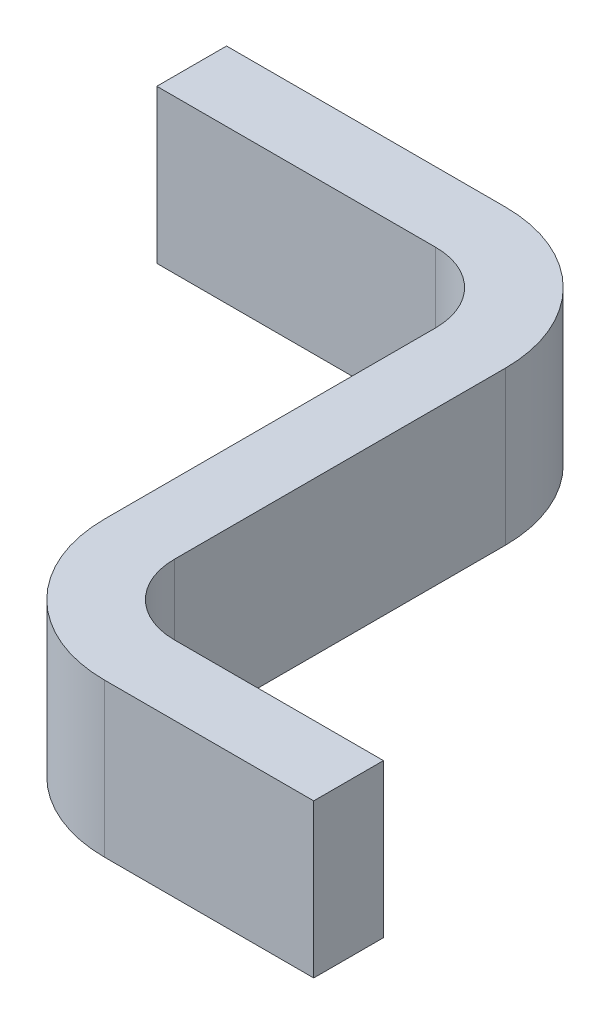
ISO-10303-21;
HEADER;
FILE_DESCRIPTION(('STEP AP214'),'2;1');
FILE_NAME('part.step','',(''),(''),'','','');
FILE_SCHEMA(('AUTOMOTIVE_DESIGN { 1 0 10303 214 1 1 1 1 }'));
ENDSEC;
DATA;
#1=APPLICATION_CONTEXT('core data for automotive mechanical design processes');
#2=APPLICATION_PROTOCOL_DEFINITION('international standard','automotive_design',2000,#1);
#3=PRODUCT_CONTEXT('',#1,'mechanical');
#4=PRODUCT('Part','Part','',(#3));
#5=PRODUCT_RELATED_PRODUCT_CATEGORY('part','',(#4));
#6=PRODUCT_DEFINITION_FORMATION('','',#4);
#7=PRODUCT_DEFINITION_CONTEXT('part definition',#1,'design');
#8=PRODUCT_DEFINITION('design','',#6,#7);
#9=PRODUCT_DEFINITION_SHAPE('','',#8);
#10=(LENGTH_UNIT() NAMED_UNIT(*) SI_UNIT(.MILLI.,.METRE.));
#11=(NAMED_UNIT(*) PLANE_ANGLE_UNIT() SI_UNIT($,.RADIAN.));
#12=(NAMED_UNIT(*) SI_UNIT($,.STERADIAN.) SOLID_ANGLE_UNIT());
#13=UNCERTAINTY_MEASURE_WITH_UNIT(LENGTH_MEASURE(1.E-05),#10,'distance_accuracy_value','');
#14=(GEOMETRIC_REPRESENTATION_CONTEXT(3) GLOBAL_UNCERTAINTY_ASSIGNED_CONTEXT((#13)) GLOBAL_UNIT_ASSIGNED_CONTEXT((#10,
#11,#12)) REPRESENTATION_CONTEXT('',''));
#15=CARTESIAN_POINT('',(0.,0.,0.));
#16=DIRECTION('',(0.,0.,1.));
#17=DIRECTION('',(1.,0.,0.));
#18=AXIS2_PLACEMENT_3D('',#15,#16,#17);
#19=CARTESIAN_POINT('',(-4.,0.86,0.675));
#20=DIRECTION('',(0.,-1.,0.));
#21=DIRECTION('',(1.,0.,0.));
#22=AXIS2_PLACEMENT_3D('',#19,#20,#21);
#23=PLANE('',#22);
#24=CARTESIAN_POINT('',(-3.8,0.860000000000001,0.675));
#25=DIRECTION('',(0.,1.,0.));
#26=DIRECTION('',(-1.,0.,0.));
#27=AXIS2_PLACEMENT_3D('',#24,#25,#26);
#28=CIRCLE('',#27,0.2);
#29=CARTESIAN_POINT('',(-3.8,0.860000000000001,0.875));
#30=VERTEX_POINT('',#29);
#31=CARTESIAN_POINT('',(-4.,0.86,0.675));
#32=VERTEX_POINT('',#31);
#33=EDGE_CURVE('E150',#30,#32,#28,.F.);
#34=ORIENTED_EDGE('',*,*,#33,.F.);
#35=DIRECTION('',(-1.,0.,0.));
#36=VECTOR('',#35,1.);
#37=CARTESIAN_POINT('',(-3.50000000000001,0.86,0.875));
#38=LINE('',#37,#36);
#39=CARTESIAN_POINT('',(-3.50000000000001,0.86,0.875));
#40=VERTEX_POINT('',#39);
#41=EDGE_CURVE('E147',#30,#40,#38,.F.);
#42=ORIENTED_EDGE('',*,*,#41,.T.);
#43=DIRECTION('',(0.,0.,1.));
#44=VECTOR('',#43,1.);
#45=CARTESIAN_POINT('',(-3.50000000000001,0.86,0.775));
#46=LINE('',#45,#44);
#47=CARTESIAN_POINT('',(-3.50000000000001,0.86,0.775));
#48=VERTEX_POINT('',#47);
#49=EDGE_CURVE('E141',#48,#40,#46,.T.);
#50=ORIENTED_EDGE('',*,*,#49,.F.);
#51=DIRECTION('',(1.,0.,0.));
#52=VECTOR('',#51,1.);
#53=CARTESIAN_POINT('',(-3.50000000000001,0.86,0.775));
#54=LINE('',#53,#52);
#55=CARTESIAN_POINT('',(-3.8,0.860000000000001,0.775));
#56=VERTEX_POINT('',#55);
#57=EDGE_CURVE('E115',#48,#56,#54,.F.);
#58=ORIENTED_EDGE('',*,*,#57,.T.);
#59=CARTESIAN_POINT('',(-3.8,0.860000000000001,0.675));
#60=DIRECTION('',(0.,1.,0.));
#61=DIRECTION('',(-1.,0.,0.));
#62=AXIS2_PLACEMENT_3D('',#59,#60,#61);
#63=CIRCLE('',#62,0.1);
#64=CARTESIAN_POINT('',(-3.90000000000001,0.860000000000001,0.675));
#65=VERTEX_POINT('',#64);
#66=EDGE_CURVE('E215',#56,#65,#63,.F.);
#67=ORIENTED_EDGE('',*,*,#66,.T.);
#68=DIRECTION('',(0.,0.,1.));
#69=VECTOR('',#68,1.);
#70=CARTESIAN_POINT('',(-3.90000000000001,0.860000000000001,0.675));
#71=LINE('',#70,#69);
#72=CARTESIAN_POINT('',(-3.90000000000001,0.860000000000001,0.2));
#73=VERTEX_POINT('',#72);
#74=EDGE_CURVE('E181',#65,#73,#71,.F.);
#75=ORIENTED_EDGE('',*,*,#74,.T.);
#76=CARTESIAN_POINT('',(-4.1,0.86,0.2));
#77=DIRECTION('',(0.,-1.,0.));
#78=DIRECTION('',(1.,0.,0.));
#79=AXIS2_PLACEMENT_3D('',#76,#77,#78);
#80=CIRCLE('',#79,0.2);
#81=CARTESIAN_POINT('',(-4.1,0.86,0.));
#82=VERTEX_POINT('',#81);
#83=EDGE_CURVE('E20',#82,#73,#80,.T.);
#84=ORIENTED_EDGE('',*,*,#83,.F.);
#85=DIRECTION('',(1.,0.,0.));
#86=VECTOR('',#85,1.);
#87=CARTESIAN_POINT('',(-4.1,0.86,0.));
#88=LINE('',#87,#86);
#89=CARTESIAN_POINT('',(-4.5,0.86,0.));
#90=VERTEX_POINT('',#89);
#91=EDGE_CURVE('E91',#82,#90,#88,.F.);
#92=ORIENTED_EDGE('',*,*,#91,.T.);
#93=DIRECTION('',(0.,0.,1.));
#94=VECTOR('',#93,1.);
#95=CARTESIAN_POINT('',(-4.5,0.86,0.));
#96=LINE('',#95,#94);
#97=CARTESIAN_POINT('',(-4.5,0.86,0.1));
#98=VERTEX_POINT('',#97);
#99=EDGE_CURVE('E163',#90,#98,#96,.T.);
#100=ORIENTED_EDGE('',*,*,#99,.T.);
#101=DIRECTION('',(-1.,0.,0.));
#102=VECTOR('',#101,1.);
#103=CARTESIAN_POINT('',(-4.1,0.86,0.1));
#104=LINE('',#103,#102);
#105=CARTESIAN_POINT('',(-4.1,0.86,0.1));
#106=VERTEX_POINT('',#105);
#107=EDGE_CURVE('E159',#98,#106,#104,.F.);
#108=ORIENTED_EDGE('',*,*,#107,.T.);
#109=CARTESIAN_POINT('',(-4.1,0.86,0.2));
#110=DIRECTION('',(0.,-1.,0.));
#111=DIRECTION('',(1.,0.,0.));
#112=AXIS2_PLACEMENT_3D('',#109,#110,#111);
#113=CIRCLE('',#112,0.1);
#114=CARTESIAN_POINT('',(-4.,0.86,0.2));
#115=VERTEX_POINT('',#114);
#116=EDGE_CURVE('E155',#106,#115,#113,.T.);
#117=ORIENTED_EDGE('',*,*,#116,.T.);
#118=DIRECTION('',(0.,0.,1.));
#119=VECTOR('',#118,1.);
#120=CARTESIAN_POINT('',(-4.,0.86,0.675));
#121=LINE('',#120,#119);
#122=EDGE_CURVE('E154',#115,#32,#121,.T.);
#123=ORIENTED_EDGE('',*,*,#122,.T.);
#124=EDGE_LOOP('',(#34,#42,#50,#58,#67,#75,#84,#92,#100,#108,#117,#123));
#125=FACE_BOUND('',#124,.T.);
#126=ADVANCED_FACE('F17',(#125),#23,.F.);
#127=CARTESIAN_POINT('',(-4.1,0.86,0.2));
#128=DIRECTION('',(0.,-1.,0.));
#129=DIRECTION('',(1.,0.,0.));
#130=AXIS2_PLACEMENT_3D('',#127,#128,#129);
#131=CYLINDRICAL_SURFACE('',#130,0.2);
#132=CARTESIAN_POINT('',(-4.1,0.64,0.2));
#133=DIRECTION('',(0.,-1.,0.));
#134=DIRECTION('',(1.,0.,0.));
#135=AXIS2_PLACEMENT_3D('',#132,#133,#134);
#136=CIRCLE('',#135,0.2);
#137=CARTESIAN_POINT('',(-3.90000000000001,0.640000000000001,0.2));
#138=VERTEX_POINT('',#137);
#139=CARTESIAN_POINT('',(-4.1,0.64,0.));
#140=VERTEX_POINT('',#139);
#141=EDGE_CURVE('E183',#138,#140,#136,.F.);
#142=ORIENTED_EDGE('',*,*,#141,.T.);
#143=DIRECTION('',(0.,1.,0.));
#144=VECTOR('',#143,1.);
#145=CARTESIAN_POINT('',(-4.1,0.86,0.));
#146=LINE('',#145,#144);
#147=EDGE_CURVE('E178',#140,#82,#146,.T.);
#148=ORIENTED_EDGE('',*,*,#147,.T.);
#149=ORIENTED_EDGE('',*,*,#83,.T.);
#150=DIRECTION('',(0.,-1.,0.));
#151=VECTOR('',#150,1.);
#152=CARTESIAN_POINT('',(-3.90000000000001,0.860000000000001,0.2));
#153=LINE('',#152,#151);
#154=EDGE_CURVE('E217',#73,#138,#153,.T.);
#155=ORIENTED_EDGE('',*,*,#154,.T.);
#156=EDGE_LOOP('',(#142,#148,#149,#155));
#157=FACE_BOUND('',#156,.T.);
#158=ADVANCED_FACE('F254',(#157),#131,.T.);
#159=CARTESIAN_POINT('',(-4.1,0.86,0.));
#160=DIRECTION('',(0.,0.,1.));
#161=DIRECTION('',(1.,0.,0.));
#162=AXIS2_PLACEMENT_3D('',#159,#160,#161);
#163=PLANE('',#162);
#164=ORIENTED_EDGE('',*,*,#147,.F.);
#165=DIRECTION('',(-1.,0.,0.));
#166=VECTOR('',#165,1.);
#167=CARTESIAN_POINT('',(-3.90000000000001,0.640000000000001,0.));
#168=LINE('',#167,#166);
#169=CARTESIAN_POINT('',(-4.5,0.64,0.));
#170=VERTEX_POINT('',#169);
#171=EDGE_CURVE('E170',#140,#170,#168,.T.);
#172=ORIENTED_EDGE('',*,*,#171,.T.);
#173=DIRECTION('',(0.,1.,0.));
#174=VECTOR('',#173,1.);
#175=CARTESIAN_POINT('',(-4.5,0.86,0.));
#176=LINE('',#175,#174);
#177=EDGE_CURVE('E173',#170,#90,#176,.T.);
#178=ORIENTED_EDGE('',*,*,#177,.T.);
#179=ORIENTED_EDGE('',*,*,#91,.F.);
#180=EDGE_LOOP('',(#164,#172,#178,#179));
#181=FACE_BOUND('',#180,.T.);
#182=ADVANCED_FACE('F257',(#181),#163,.F.);
#183=CARTESIAN_POINT('',(-4.5,0.86,0.));
#184=DIRECTION('',(1.,0.,0.));
#185=DIRECTION('',(0.,1.,0.));
#186=AXIS2_PLACEMENT_3D('',#183,#184,#185);
#187=PLANE('',#186);
#188=DIRECTION('',(0.,1.,0.));
#189=VECTOR('',#188,1.);
#190=CARTESIAN_POINT('',(-4.5,0.64,0.1));
#191=LINE('',#190,#189);
#192=CARTESIAN_POINT('',(-4.5,0.64,0.1));
#193=VERTEX_POINT('',#192);
#194=EDGE_CURVE('E160',#193,#98,#191,.T.);
#195=ORIENTED_EDGE('',*,*,#194,.T.);
#196=ORIENTED_EDGE('',*,*,#99,.F.);
#197=ORIENTED_EDGE('',*,*,#177,.F.);
#198=DIRECTION('',(0.,0.,1.));
#199=VECTOR('',#198,1.);
#200=CARTESIAN_POINT('',(-4.5,0.64,0.675));
#201=LINE('',#200,#199);
#202=EDGE_CURVE('E166',#170,#193,#201,.T.);
#203=ORIENTED_EDGE('',*,*,#202,.T.);
#204=EDGE_LOOP('',(#195,#196,#197,#203));
#205=FACE_BOUND('',#204,.T.);
#206=ADVANCED_FACE('F259',(#205),#187,.F.);
#207=CARTESIAN_POINT('',(-4.1,0.64,0.1));
#208=DIRECTION('',(0.,0.,-1.));
#209=DIRECTION('',(-1.,0.,0.));
#210=AXIS2_PLACEMENT_3D('',#207,#208,#209);
#211=PLANE('',#210);
#212=DIRECTION('',(0.,-1.,0.));
#213=VECTOR('',#212,1.);
#214=CARTESIAN_POINT('',(-4.1,0.64,0.1));
#215=LINE('',#214,#213);
#216=CARTESIAN_POINT('',(-4.1,0.64,0.1));
#217=VERTEX_POINT('',#216);
#218=EDGE_CURVE('E156',#217,#106,#215,.F.);
#219=ORIENTED_EDGE('',*,*,#218,.T.);
#220=ORIENTED_EDGE('',*,*,#107,.F.);
#221=ORIENTED_EDGE('',*,*,#194,.F.);
#222=DIRECTION('',(-1.,0.,0.));
#223=VECTOR('',#222,1.);
#224=CARTESIAN_POINT('',(-3.90000000000001,0.640000000000001,0.1));
#225=LINE('',#224,#223);
#226=EDGE_CURVE('E169',#193,#217,#225,.F.);
#227=ORIENTED_EDGE('',*,*,#226,.T.);
#228=EDGE_LOOP('',(#219,#220,#221,#227));
#229=FACE_BOUND('',#228,.T.);
#230=ADVANCED_FACE('F234',(#229),#211,.F.);
#231=CARTESIAN_POINT('',(-4.1,0.64,0.2));
#232=DIRECTION('',(0.,-1.,0.));
#233=DIRECTION('',(1.,0.,0.));
#234=AXIS2_PLACEMENT_3D('',#231,#232,#233);
#235=CYLINDRICAL_SURFACE('',#234,0.1);
#236=DIRECTION('',(0.,1.,0.));
#237=VECTOR('',#236,1.);
#238=CARTESIAN_POINT('',(-4.,0.64,0.2));
#239=LINE('',#238,#237);
#240=CARTESIAN_POINT('',(-4.,0.64,0.2));
#241=VERTEX_POINT('',#240);
#242=EDGE_CURVE('E151',#241,#115,#239,.T.);
#243=ORIENTED_EDGE('',*,*,#242,.T.);
#244=ORIENTED_EDGE('',*,*,#116,.F.);
#245=ORIENTED_EDGE('',*,*,#218,.F.);
#246=CARTESIAN_POINT('',(-4.1,0.64,0.2));
#247=DIRECTION('',(0.,-1.,0.));
#248=DIRECTION('',(1.,0.,0.));
#249=AXIS2_PLACEMENT_3D('',#246,#247,#248);
#250=CIRCLE('',#249,0.1);
#251=EDGE_CURVE('E210',#217,#241,#250,.T.);
#252=ORIENTED_EDGE('',*,*,#251,.T.);
#253=EDGE_LOOP('',(#243,#244,#245,#252));
#254=FACE_BOUND('',#253,.T.);
#255=ADVANCED_FACE('F227',(#254),#235,.F.);
#256=CARTESIAN_POINT('',(-4.,0.64,0.675));
#257=DIRECTION('',(1.,0.,0.));
#258=DIRECTION('',(0.,1.,0.));
#259=AXIS2_PLACEMENT_3D('',#256,#257,#258);
#260=PLANE('',#259);
#261=DIRECTION('',(0.,1.,0.));
#262=VECTOR('',#261,1.);
#263=CARTESIAN_POINT('',(-4.,0.64,0.675));
#264=LINE('',#263,#262);
#265=CARTESIAN_POINT('',(-4.,0.64,0.675));
#266=VERTEX_POINT('',#265);
#267=EDGE_CURVE('E148',#32,#266,#264,.F.);
#268=ORIENTED_EDGE('',*,*,#267,.F.);
#269=ORIENTED_EDGE('',*,*,#122,.F.);
#270=ORIENTED_EDGE('',*,*,#242,.F.);
#271=DIRECTION('',(0.,0.,1.));
#272=VECTOR('',#271,1.);
#273=CARTESIAN_POINT('',(-4.,0.64,0.675));
#274=LINE('',#273,#272);
#275=EDGE_CURVE('E209',#241,#266,#274,.T.);
#276=ORIENTED_EDGE('',*,*,#275,.T.);
#277=EDGE_LOOP('',(#268,#269,#270,#276));
#278=FACE_BOUND('',#277,.T.);
#279=ADVANCED_FACE('F224',(#278),#260,.F.);
#280=CARTESIAN_POINT('',(-3.8,0.640000000000001,0.675));
#281=DIRECTION('',(0.,1.,0.));
#282=DIRECTION('',(-1.,0.,0.));
#283=AXIS2_PLACEMENT_3D('',#280,#281,#282);
#284=CYLINDRICAL_SURFACE('',#283,0.2);
#285=ORIENTED_EDGE('',*,*,#33,.T.);
#286=ORIENTED_EDGE('',*,*,#267,.T.);
#287=CARTESIAN_POINT('',(-3.8,0.640000000000001,0.675));
#288=DIRECTION('',(0.,1.,0.));
#289=DIRECTION('',(-1.,0.,0.));
#290=AXIS2_PLACEMENT_3D('',#287,#288,#289);
#291=CIRCLE('',#290,0.2);
#292=CARTESIAN_POINT('',(-3.8,0.640000000000001,0.875));
#293=VERTEX_POINT('',#292);
#294=EDGE_CURVE('E133',#266,#293,#291,.T.);
#295=ORIENTED_EDGE('',*,*,#294,.T.);
#296=DIRECTION('',(0.,1.,0.));
#297=VECTOR('',#296,1.);
#298=CARTESIAN_POINT('',(-3.8,0.640000000000001,0.875));
#299=LINE('',#298,#297);
#300=EDGE_CURVE('E144',#293,#30,#299,.T.);
#301=ORIENTED_EDGE('',*,*,#300,.T.);
#302=EDGE_LOOP('',(#285,#286,#295,#301));
#303=FACE_BOUND('',#302,.T.);
#304=ADVANCED_FACE('F285',(#303),#284,.T.);
#305=CARTESIAN_POINT('',(-3.50000000000001,0.64,0.875));
#306=DIRECTION('',(0.,0.,-1.));
#307=DIRECTION('',(-1.,0.,0.));
#308=AXIS2_PLACEMENT_3D('',#305,#306,#307);
#309=PLANE('',#308);
#310=DIRECTION('',(0.,1.,0.));
#311=VECTOR('',#310,1.);
#312=CARTESIAN_POINT('',(-3.50000000000001,0.86,0.875));
#313=LINE('',#312,#311);
#314=CARTESIAN_POINT('',(-3.50000000000001,0.64,0.875));
#315=VERTEX_POINT('',#314);
#316=EDGE_CURVE('E118',#40,#315,#313,.F.);
#317=ORIENTED_EDGE('',*,*,#316,.F.);
#318=ORIENTED_EDGE('',*,*,#41,.F.);
#319=ORIENTED_EDGE('',*,*,#300,.F.);
#320=DIRECTION('',(-1.,0.,0.));
#321=VECTOR('',#320,1.);
#322=CARTESIAN_POINT('',(-3.90000000000001,0.640000000000001,0.875));
#323=LINE('',#322,#321);
#324=EDGE_CURVE('E131',#293,#315,#323,.F.);
#325=ORIENTED_EDGE('',*,*,#324,.T.);
#326=EDGE_LOOP('',(#317,#318,#319,#325));
#327=FACE_BOUND('',#326,.T.);
#328=ADVANCED_FACE('F282',(#327),#309,.F.);
#329=CARTESIAN_POINT('',(-3.50000000000001,0.86,0.775));
#330=DIRECTION('',(1.,0.,0.));
#331=DIRECTION('',(0.,1.,0.));
#332=AXIS2_PLACEMENT_3D('',#329,#330,#331);
#333=PLANE('',#332);
#334=ORIENTED_EDGE('',*,*,#49,.T.);
#335=ORIENTED_EDGE('',*,*,#316,.T.);
#336=DIRECTION('',(0.,0.,1.));
#337=VECTOR('',#336,1.);
#338=CARTESIAN_POINT('',(-3.50000000000001,0.64,0.675));
#339=LINE('',#338,#337);
#340=CARTESIAN_POINT('',(-3.50000000000001,0.64,0.775));
#341=VERTEX_POINT('',#340);
#342=EDGE_CURVE('E125',#315,#341,#339,.F.);
#343=ORIENTED_EDGE('',*,*,#342,.T.);
#344=DIRECTION('',(0.,1.,0.));
#345=VECTOR('',#344,1.);
#346=CARTESIAN_POINT('',(-3.50000000000001,0.86,0.775));
#347=LINE('',#346,#345);
#348=EDGE_CURVE('E110',#341,#48,#347,.T.);
#349=ORIENTED_EDGE('',*,*,#348,.T.);
#350=EDGE_LOOP('',(#334,#335,#343,#349));
#351=FACE_BOUND('',#350,.T.);
#352=ADVANCED_FACE('F129',(#351),#333,.T.);
#353=CARTESIAN_POINT('',(-3.50000000000001,0.86,0.775));
#354=DIRECTION('',(0.,0.,1.));
#355=DIRECTION('',(1.,0.,0.));
#356=AXIS2_PLACEMENT_3D('',#353,#354,#355);
#357=PLANE('',#356);
#358=ORIENTED_EDGE('',*,*,#348,.F.);
#359=DIRECTION('',(-1.,0.,0.));
#360=VECTOR('',#359,1.);
#361=CARTESIAN_POINT('',(-3.90000000000001,0.640000000000001,0.775));
#362=LINE('',#361,#360);
#363=CARTESIAN_POINT('',(-3.8,0.640000000000001,0.775));
#364=VERTEX_POINT('',#363);
#365=EDGE_CURVE('E114',#341,#364,#362,.T.);
#366=ORIENTED_EDGE('',*,*,#365,.T.);
#367=DIRECTION('',(0.,1.,0.));
#368=VECTOR('',#367,1.);
#369=CARTESIAN_POINT('',(-3.8,0.860000000000001,0.775));
#370=LINE('',#369,#368);
#371=EDGE_CURVE('E185',#364,#56,#370,.T.);
#372=ORIENTED_EDGE('',*,*,#371,.T.);
#373=ORIENTED_EDGE('',*,*,#57,.F.);
#374=EDGE_LOOP('',(#358,#366,#372,#373));
#375=FACE_BOUND('',#374,.T.);
#376=ADVANCED_FACE('F112',(#375),#357,.F.);
#377=CARTESIAN_POINT('',(-3.8,0.860000000000001,0.675));
#378=DIRECTION('',(0.,1.,0.));
#379=DIRECTION('',(-1.,0.,0.));
#380=AXIS2_PLACEMENT_3D('',#377,#378,#379);
#381=CYLINDRICAL_SURFACE('',#380,0.1);
#382=ORIENTED_EDGE('',*,*,#371,.F.);
#383=CARTESIAN_POINT('',(-3.8,0.640000000000001,0.675));
#384=DIRECTION('',(0.,1.,0.));
#385=DIRECTION('',(-1.,0.,0.));
#386=AXIS2_PLACEMENT_3D('',#383,#384,#385);
#387=CIRCLE('',#386,0.1);
#388=CARTESIAN_POINT('',(-3.90000000000001,0.640000000000001,0.675));
#389=VERTEX_POINT('',#388);
#390=EDGE_CURVE('E26',#364,#389,#387,.F.);
#391=ORIENTED_EDGE('',*,*,#390,.T.);
#392=DIRECTION('',(0.,-1.,0.));
#393=VECTOR('',#392,1.);
#394=CARTESIAN_POINT('',(-3.90000000000001,0.860000000000001,0.675));
#395=LINE('',#394,#393);
#396=EDGE_CURVE('E34',#389,#65,#395,.F.);
#397=ORIENTED_EDGE('',*,*,#396,.T.);
#398=ORIENTED_EDGE('',*,*,#66,.F.);
#399=EDGE_LOOP('',(#382,#391,#397,#398));
#400=FACE_BOUND('',#399,.T.);
#401=ADVANCED_FACE('F250',(#400),#381,.F.);
#402=CARTESIAN_POINT('',(-3.90000000000001,0.860000000000001,0.675));
#403=DIRECTION('',(-1.,0.,0.));
#404=DIRECTION('',(0.,-1.,0.));
#405=AXIS2_PLACEMENT_3D('',#402,#403,#404);
#406=PLANE('',#405);
#407=ORIENTED_EDGE('',*,*,#396,.F.);
#408=DIRECTION('',(0.,0.,1.));
#409=VECTOR('',#408,1.);
#410=CARTESIAN_POINT('',(-3.90000000000001,0.640000000000001,0.675));
#411=LINE('',#410,#409);
#412=EDGE_CURVE('E11',#389,#138,#411,.F.);
#413=ORIENTED_EDGE('',*,*,#412,.T.);
#414=ORIENTED_EDGE('',*,*,#154,.F.);
#415=ORIENTED_EDGE('',*,*,#74,.F.);
#416=EDGE_LOOP('',(#407,#413,#414,#415));
#417=FACE_BOUND('',#416,.T.);
#418=ADVANCED_FACE('F252',(#417),#406,.F.);
#419=CARTESIAN_POINT('',(-3.90000000000001,0.640000000000001,0.675));
#420=DIRECTION('',(0.,1.,0.));
#421=DIRECTION('',(-1.,0.,0.));
#422=AXIS2_PLACEMENT_3D('',#419,#420,#421);
#423=PLANE('',#422);
#424=ORIENTED_EDGE('',*,*,#390,.F.);
#425=ORIENTED_EDGE('',*,*,#365,.F.);
#426=ORIENTED_EDGE('',*,*,#342,.F.);
#427=ORIENTED_EDGE('',*,*,#324,.F.);
#428=ORIENTED_EDGE('',*,*,#294,.F.);
#429=ORIENTED_EDGE('',*,*,#275,.F.);
#430=ORIENTED_EDGE('',*,*,#251,.F.);
#431=ORIENTED_EDGE('',*,*,#226,.F.);
#432=ORIENTED_EDGE('',*,*,#202,.F.);
#433=ORIENTED_EDGE('',*,*,#171,.F.);
#434=ORIENTED_EDGE('',*,*,#141,.F.);
#435=ORIENTED_EDGE('',*,*,#412,.F.);
#436=EDGE_LOOP('',(#424,#425,#426,#427,#428,#429,#430,#431,#432,#433,#434,#435));
#437=FACE_BOUND('',#436,.T.);
#438=ADVANCED_FACE('F123',(#437),#423,.F.);
#439=CLOSED_SHELL('',(#126,#158,#182,#206,#230,#255,#279,#304,#328,#352,#376,#401,#418,#438));
#440=MANIFOLD_SOLID_BREP('B1',#439);
#441=ADVANCED_BREP_SHAPE_REPRESENTATION('',(#18,#440),#14);
#442=SHAPE_DEFINITION_REPRESENTATION(#9,#441);
ENDSEC;
END-ISO-10303-21;
